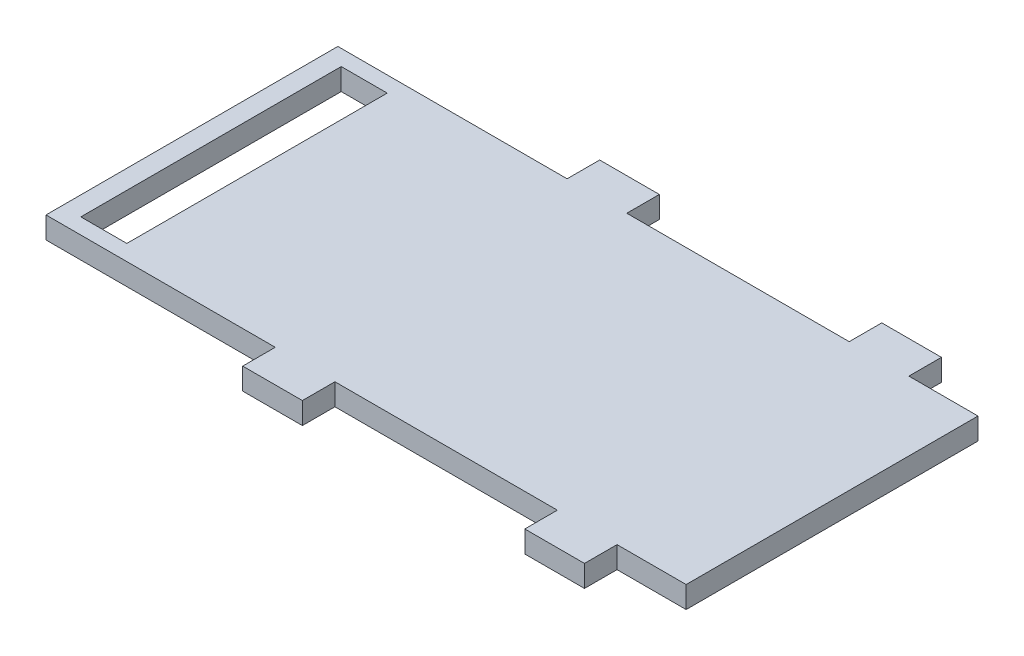
ISO-10303-21;
HEADER;
FILE_DESCRIPTION(('STEP AP214'),'2;1');
FILE_NAME('part.step','',(''),(''),'','','');
FILE_SCHEMA(('AUTOMOTIVE_DESIGN { 1 0 10303 214 1 1 1 1 }'));
ENDSEC;
DATA;
#1=APPLICATION_CONTEXT('core data for automotive mechanical design processes');
#2=APPLICATION_PROTOCOL_DEFINITION('international standard','automotive_design',2000,#1);
#3=PRODUCT_CONTEXT('',#1,'mechanical');
#4=PRODUCT('Part','Part','',(#3));
#5=PRODUCT_RELATED_PRODUCT_CATEGORY('part','',(#4));
#6=PRODUCT_DEFINITION_FORMATION('','',#4);
#7=PRODUCT_DEFINITION_CONTEXT('part definition',#1,'design');
#8=PRODUCT_DEFINITION('design','',#6,#7);
#9=PRODUCT_DEFINITION_SHAPE('','',#8);
#10=(LENGTH_UNIT() NAMED_UNIT(*) SI_UNIT(.MILLI.,.METRE.));
#11=(NAMED_UNIT(*) PLANE_ANGLE_UNIT() SI_UNIT($,.RADIAN.));
#12=(NAMED_UNIT(*) SI_UNIT($,.STERADIAN.) SOLID_ANGLE_UNIT());
#13=UNCERTAINTY_MEASURE_WITH_UNIT(LENGTH_MEASURE(1.E-05),#10,'distance_accuracy_value','');
#14=(GEOMETRIC_REPRESENTATION_CONTEXT(3) GLOBAL_UNCERTAINTY_ASSIGNED_CONTEXT((#13)) GLOBAL_UNIT_ASSIGNED_CONTEXT((#10,
#11,#12)) REPRESENTATION_CONTEXT('',''));
#15=CARTESIAN_POINT('',(0.,0.,0.));
#16=DIRECTION('',(0.,0.,1.));
#17=DIRECTION('',(1.,0.,0.));
#18=AXIS2_PLACEMENT_3D('',#15,#16,#17);
#19=CARTESIAN_POINT('',(-50.7984236509872,1.,18.7804542334295));
#20=DIRECTION('',(0.,0.,-1.));
#21=DIRECTION('',(-1.,0.,0.));
#22=AXIS2_PLACEMENT_3D('',#19,#20,#21);
#23=PLANE('',#22);
#24=DIRECTION('',(0.,-1.,0.));
#25=VECTOR('',#24,1.);
#26=CARTESIAN_POINT('',(-27.2334236509872,1.,18.7804542334295));
#27=LINE('',#26,#25);
#28=CARTESIAN_POINT('',(-27.2334236509872,1.,18.7804542334295));
#29=VERTEX_POINT('',#28);
#30=CARTESIAN_POINT('',(-27.2334236509872,0.,18.7804542334295));
#31=VERTEX_POINT('',#30);
#32=EDGE_CURVE('E243',#29,#31,#27,.T.);
#33=ORIENTED_EDGE('',*,*,#32,.F.);
#34=DIRECTION('',(1.,0.,0.));
#35=VECTOR('',#34,1.);
#36=CARTESIAN_POINT('',(-50.7984236509872,1.,18.7804542334295));
#37=LINE('',#36,#35);
#38=CARTESIAN_POINT('',(-37.4834236509872,1.,18.7804542334295));
#39=VERTEX_POINT('',#38);
#40=EDGE_CURVE('E428',#39,#29,#37,.T.);
#41=ORIENTED_EDGE('',*,*,#40,.F.);
#42=DIRECTION('',(0.,-1.,0.));
#43=VECTOR('',#42,1.);
#44=CARTESIAN_POINT('',(-37.4834236509872,1.,18.7804542334295));
#45=LINE('',#44,#43);
#46=CARTESIAN_POINT('',(-37.4834236509872,0.,18.7804542334295));
#47=VERTEX_POINT('',#46);
#48=EDGE_CURVE('E303',#39,#47,#45,.T.);
#49=ORIENTED_EDGE('',*,*,#48,.T.);
#50=DIRECTION('',(1.,0.,0.));
#51=VECTOR('',#50,1.);
#52=CARTESIAN_POINT('',(-50.7984236509872,0.,18.7804542334295));
#53=LINE('',#52,#51);
#54=EDGE_CURVE('E367',#47,#31,#53,.T.);
#55=ORIENTED_EDGE('',*,*,#54,.T.);
#56=EDGE_LOOP('',(#33,#41,#49,#55));
#57=FACE_BOUND('',#56,.T.);
#58=ADVANCED_FACE('F33',(#57),#23,.F.);
#59=DIRECTION('',(0.,-1.,0.));
#60=VECTOR('',#59,1.);
#61=CARTESIAN_POINT('',(-24.4834236509872,1.,18.7804542334295));
#62=LINE('',#61,#60);
#63=CARTESIAN_POINT('',(-24.4834236509872,1.,18.7804542334295));
#64=VERTEX_POINT('',#63);
#65=CARTESIAN_POINT('',(-24.4834236509872,0.,18.7804542334295));
#66=VERTEX_POINT('',#65);
#67=EDGE_CURVE('E252',#64,#66,#62,.T.);
#68=ORIENTED_EDGE('',*,*,#67,.T.);
#69=CARTESIAN_POINT('',(-21.2984236509872,0.,18.7804542334295));
#70=VERTEX_POINT('',#69);
#71=EDGE_CURVE('E361',#66,#70,#53,.T.);
#72=ORIENTED_EDGE('',*,*,#71,.T.);
#73=DIRECTION('',(0.,-1.,0.));
#74=VECTOR('',#73,1.);
#75=CARTESIAN_POINT('',(-21.2984236509872,1.,18.7804542334295));
#76=LINE('',#75,#74);
#77=CARTESIAN_POINT('',(-21.2984236509872,1.,18.7804542334295));
#78=VERTEX_POINT('',#77);
#79=EDGE_CURVE('E43',#78,#70,#76,.T.);
#80=ORIENTED_EDGE('',*,*,#79,.F.);
#81=EDGE_CURVE('E37',#64,#78,#37,.T.);
#82=ORIENTED_EDGE('',*,*,#81,.F.);
#83=EDGE_LOOP('',(#68,#72,#80,#82));
#84=FACE_BOUND('',#83,.T.);
#85=ADVANCED_FACE('F467',(#84),#23,.F.);
#86=CARTESIAN_POINT('',(-50.7984236509872,1.,5.33045423342954));
#87=DIRECTION('',(0.,0.,1.));
#88=DIRECTION('',(1.,0.,0.));
#89=AXIS2_PLACEMENT_3D('',#86,#87,#88);
#90=PLANE('',#89);
#91=DIRECTION('',(0.,-1.,0.));
#92=VECTOR('',#91,1.);
#93=CARTESIAN_POINT('',(-24.4834236509872,1.,5.33045423342954));
#94=LINE('',#93,#92);
#95=CARTESIAN_POINT('',(-24.4834236509872,1.,5.33045423342954));
#96=VERTEX_POINT('',#95);
#97=CARTESIAN_POINT('',(-24.4834236509872,0.,5.33045423342954));
#98=VERTEX_POINT('',#97);
#99=EDGE_CURVE('E284',#96,#98,#94,.T.);
#100=ORIENTED_EDGE('',*,*,#99,.F.);
#101=DIRECTION('',(-1.,0.,0.));
#102=VECTOR('',#101,1.);
#103=CARTESIAN_POINT('',(-50.7984236509872,1.,5.33045423342954));
#104=LINE('',#103,#102);
#105=CARTESIAN_POINT('',(-21.2984236509872,1.,5.33045423342954));
#106=VERTEX_POINT('',#105);
#107=EDGE_CURVE('E343',#106,#96,#104,.T.);
#108=ORIENTED_EDGE('',*,*,#107,.F.);
#109=DIRECTION('',(0.,-1.,0.));
#110=VECTOR('',#109,1.);
#111=CARTESIAN_POINT('',(-21.2984236509872,1.,5.33045423342954));
#112=LINE('',#111,#110);
#113=CARTESIAN_POINT('',(-21.2984236509872,0.,5.33045423342954));
#114=VERTEX_POINT('',#113);
#115=EDGE_CURVE('E336',#106,#114,#112,.T.);
#116=ORIENTED_EDGE('',*,*,#115,.T.);
#117=DIRECTION('',(-1.,0.,0.));
#118=VECTOR('',#117,1.);
#119=CARTESIAN_POINT('',(-50.7984236509872,0.,5.33045423342954));
#120=LINE('',#119,#118);
#121=EDGE_CURVE('E317',#114,#98,#120,.T.);
#122=ORIENTED_EDGE('',*,*,#121,.T.);
#123=EDGE_LOOP('',(#100,#108,#116,#122));
#124=FACE_BOUND('',#123,.T.);
#125=ADVANCED_FACE('F493',(#124),#90,.F.);
#126=DIRECTION('',(0.,-1.,0.));
#127=VECTOR('',#126,1.);
#128=CARTESIAN_POINT('',(-27.2334236509872,1.,5.33045423342954));
#129=LINE('',#128,#127);
#130=CARTESIAN_POINT('',(-27.2334236509872,1.,5.33045423342954));
#131=VERTEX_POINT('',#130);
#132=CARTESIAN_POINT('',(-27.2334236509872,0.,5.33045423342954));
#133=VERTEX_POINT('',#132);
#134=EDGE_CURVE('E270',#131,#133,#129,.T.);
#135=ORIENTED_EDGE('',*,*,#134,.T.);
#136=CARTESIAN_POINT('',(-37.4834236509872,0.,5.33045423342954));
#137=VERTEX_POINT('',#136);
#138=EDGE_CURVE('E314',#133,#137,#120,.T.);
#139=ORIENTED_EDGE('',*,*,#138,.T.);
#140=DIRECTION('',(0.,-1.,0.));
#141=VECTOR('',#140,1.);
#142=CARTESIAN_POINT('',(-37.4834236509872,1.,5.33045423342954));
#143=LINE('',#142,#141);
#144=CARTESIAN_POINT('',(-37.4834236509872,1.,5.33045423342954));
#145=VERTEX_POINT('',#144);
#146=EDGE_CURVE('E385',#145,#137,#143,.T.);
#147=ORIENTED_EDGE('',*,*,#146,.F.);
#148=EDGE_CURVE('E319',#131,#145,#104,.T.);
#149=ORIENTED_EDGE('',*,*,#148,.F.);
#150=EDGE_LOOP('',(#135,#139,#147,#149));
#151=FACE_BOUND('',#150,.T.);
#152=ADVANCED_FACE('F496',(#151),#90,.F.);
#153=DIRECTION('',(0.,-1.,0.));
#154=VECTOR('',#153,1.);
#155=CARTESIAN_POINT('',(-40.2334236509872,1.,18.7804542334295));
#156=LINE('',#155,#154);
#157=CARTESIAN_POINT('',(-40.2334236509872,1.,18.7804542334295));
#158=VERTEX_POINT('',#157);
#159=CARTESIAN_POINT('',(-40.2334236509872,0.,18.7804542334295));
#160=VERTEX_POINT('',#159);
#161=EDGE_CURVE('E300',#158,#160,#156,.T.);
#162=ORIENTED_EDGE('',*,*,#161,.F.);
#163=CARTESIAN_POINT('',(-50.7984236509872,1.,18.7804542334295));
#164=VERTEX_POINT('',#163);
#165=EDGE_CURVE('E425',#164,#158,#37,.T.);
#166=ORIENTED_EDGE('',*,*,#165,.F.);
#167=DIRECTION('',(0.,-1.,0.));
#168=VECTOR('',#167,1.);
#169=CARTESIAN_POINT('',(-50.7984236509872,1.,18.7804542334295));
#170=LINE('',#169,#168);
#171=CARTESIAN_POINT('',(-50.7984236509872,0.,18.7804542334295));
#172=VERTEX_POINT('',#171);
#173=EDGE_CURVE('E11',#164,#172,#170,.T.);
#174=ORIENTED_EDGE('',*,*,#173,.T.);
#175=EDGE_CURVE('E370',#172,#160,#53,.T.);
#176=ORIENTED_EDGE('',*,*,#175,.T.);
#177=EDGE_LOOP('',(#162,#166,#174,#176));
#178=FACE_BOUND('',#177,.T.);
#179=ADVANCED_FACE('F471',(#178),#23,.F.);
#180=CARTESIAN_POINT('',(-50.7984236509872,1.,5.33045423342954));
#181=DIRECTION('',(1.,0.,0.));
#182=DIRECTION('',(0.,0.,-1.));
#183=AXIS2_PLACEMENT_3D('',#180,#181,#182);
#184=PLANE('',#183);
#185=DIRECTION('',(0.,0.,1.));
#186=VECTOR('',#185,1.);
#187=CARTESIAN_POINT('',(-50.7984236509872,0.,5.33045423342954));
#188=LINE('',#187,#186);
#189=CARTESIAN_POINT('',(-50.7984236509872,0.,5.33045423342954));
#190=VERTEX_POINT('',#189);
#191=EDGE_CURVE('E358',#190,#172,#188,.T.);
#192=ORIENTED_EDGE('',*,*,#191,.T.);
#193=ORIENTED_EDGE('',*,*,#173,.F.);
#194=DIRECTION('',(0.,0.,1.));
#195=VECTOR('',#194,1.);
#196=CARTESIAN_POINT('',(-50.7984236509872,1.,5.33045423342954));
#197=LINE('',#196,#195);
#198=CARTESIAN_POINT('',(-50.7984236509872,1.,5.33045423342954));
#199=VERTEX_POINT('',#198);
#200=EDGE_CURVE('E333',#199,#164,#197,.T.);
#201=ORIENTED_EDGE('',*,*,#200,.F.);
#202=DIRECTION('',(0.,-1.,0.));
#203=VECTOR('',#202,1.);
#204=CARTESIAN_POINT('',(-50.7984236509872,1.,5.33045423342954));
#205=LINE('',#204,#203);
#206=EDGE_CURVE('E326',#199,#190,#205,.T.);
#207=ORIENTED_EDGE('',*,*,#206,.T.);
#208=EDGE_LOOP('',(#192,#193,#201,#207));
#209=FACE_BOUND('',#208,.T.);
#210=ADVANCED_FACE('F35',(#209),#184,.F.);
#211=CARTESIAN_POINT('',(-21.2984236509872,1.,5.33045423342954));
#212=DIRECTION('',(-1.,0.,0.));
#213=DIRECTION('',(0.,0.,1.));
#214=AXIS2_PLACEMENT_3D('',#211,#212,#213);
#215=PLANE('',#214);
#216=DIRECTION('',(0.,0.,-1.));
#217=VECTOR('',#216,1.);
#218=CARTESIAN_POINT('',(-21.2984236509872,0.,5.33045423342954));
#219=LINE('',#218,#217);
#220=EDGE_CURVE('E324',#70,#114,#219,.T.);
#221=ORIENTED_EDGE('',*,*,#220,.T.);
#222=ORIENTED_EDGE('',*,*,#115,.F.);
#223=DIRECTION('',(0.,0.,-1.));
#224=VECTOR('',#223,1.);
#225=CARTESIAN_POINT('',(-21.2984236509872,1.,5.33045423342954));
#226=LINE('',#225,#224);
#227=EDGE_CURVE('E357',#78,#106,#226,.T.);
#228=ORIENTED_EDGE('',*,*,#227,.F.);
#229=ORIENTED_EDGE('',*,*,#79,.T.);
#230=EDGE_LOOP('',(#221,#222,#228,#229));
#231=FACE_BOUND('',#230,.T.);
#232=ADVANCED_FACE('F501',(#231),#215,.F.);
#233=CARTESIAN_POINT('',(-40.2334236509872,1.,5.33045423342954));
#234=VERTEX_POINT('',#233);
#235=EDGE_CURVE('E351',#234,#199,#104,.T.);
#236=ORIENTED_EDGE('',*,*,#235,.F.);
#237=DIRECTION('',(0.,-1.,0.));
#238=VECTOR('',#237,1.);
#239=CARTESIAN_POINT('',(-40.2334236509872,1.,5.33045423342954));
#240=LINE('',#239,#238);
#241=CARTESIAN_POINT('',(-40.2334236509872,0.,5.33045423342954));
#242=VERTEX_POINT('',#241);
#243=EDGE_CURVE('E362',#234,#242,#240,.T.);
#244=ORIENTED_EDGE('',*,*,#243,.T.);
#245=EDGE_CURVE('E318',#242,#190,#120,.T.);
#246=ORIENTED_EDGE('',*,*,#245,.T.);
#247=ORIENTED_EDGE('',*,*,#206,.F.);
#248=EDGE_LOOP('',(#236,#244,#246,#247));
#249=FACE_BOUND('',#248,.T.);
#250=ADVANCED_FACE('F424',(#249),#90,.F.);
#251=CARTESIAN_POINT('',(0.,1.,0.));
#252=DIRECTION('',(0.,1.,0.));
#253=DIRECTION('',(0.,0.,1.));
#254=AXIS2_PLACEMENT_3D('',#251,#252,#253);
#255=PLANE('',#254);
#256=DIRECTION('',(0.,0.,-1.));
#257=VECTOR('',#256,1.);
#258=CARTESIAN_POINT('',(-49.9184236509872,1.,18.0554542334295));
#259=LINE('',#258,#257);
#260=CARTESIAN_POINT('',(-49.9184236509872,1.,18.0554542334295));
#261=VERTEX_POINT('',#260);
#262=CARTESIAN_POINT('',(-49.9184236509872,1.,6.05545423342955));
#263=VERTEX_POINT('',#262);
#264=EDGE_CURVE('E199',#261,#263,#259,.T.);
#265=ORIENTED_EDGE('',*,*,#264,.T.);
#266=DIRECTION('',(1.,0.,0.));
#267=VECTOR('',#266,1.);
#268=CARTESIAN_POINT('',(-49.9184236509872,1.,6.05545423342955));
#269=LINE('',#268,#267);
#270=CARTESIAN_POINT('',(-47.7984236509872,1.,6.05545423342955));
#271=VERTEX_POINT('',#270);
#272=EDGE_CURVE('E208',#263,#271,#269,.T.);
#273=ORIENTED_EDGE('',*,*,#272,.T.);
#274=DIRECTION('',(0.,0.,1.));
#275=VECTOR('',#274,1.);
#276=CARTESIAN_POINT('',(-47.7984236509872,1.,18.0554542334295));
#277=LINE('',#276,#275);
#278=CARTESIAN_POINT('',(-47.7984236509872,1.,18.0554542334295));
#279=VERTEX_POINT('',#278);
#280=EDGE_CURVE('E51',#271,#279,#277,.T.);
#281=ORIENTED_EDGE('',*,*,#280,.T.);
#282=DIRECTION('',(-1.,0.,0.));
#283=VECTOR('',#282,1.);
#284=CARTESIAN_POINT('',(-49.9184236509872,1.,18.0554542334295));
#285=LINE('',#284,#283);
#286=EDGE_CURVE('E205',#279,#261,#285,.T.);
#287=ORIENTED_EDGE('',*,*,#286,.T.);
#288=EDGE_LOOP('',(#265,#273,#281,#287));
#289=FACE_BOUND('',#288,.T.);
#290=ORIENTED_EDGE('',*,*,#200,.T.);
#291=ORIENTED_EDGE('',*,*,#165,.T.);
#292=DIRECTION('',(0.,0.,1.));
#293=VECTOR('',#292,1.);
#294=CARTESIAN_POINT('',(-40.2334236509872,1.,18.7804542334295));
#295=LINE('',#294,#293);
#296=CARTESIAN_POINT('',(-40.2334236509872,1.,20.2804542334295));
#297=VERTEX_POINT('',#296);
#298=EDGE_CURVE('E291',#158,#297,#295,.T.);
#299=ORIENTED_EDGE('',*,*,#298,.T.);
#300=DIRECTION('',(1.,0.,0.));
#301=VECTOR('',#300,1.);
#302=CARTESIAN_POINT('',(-40.2334236509872,1.,20.2804542334295));
#303=LINE('',#302,#301);
#304=CARTESIAN_POINT('',(-37.4834236509872,1.,20.2804542334295));
#305=VERTEX_POINT('',#304);
#306=EDGE_CURVE('E288',#297,#305,#303,.T.);
#307=ORIENTED_EDGE('',*,*,#306,.T.);
#308=DIRECTION('',(0.,0.,-1.));
#309=VECTOR('',#308,1.);
#310=CARTESIAN_POINT('',(-37.4834236509872,1.,18.7804542334295));
#311=LINE('',#310,#309);
#312=EDGE_CURVE('E290',#305,#39,#311,.T.);
#313=ORIENTED_EDGE('',*,*,#312,.T.);
#314=ORIENTED_EDGE('',*,*,#40,.T.);
#315=DIRECTION('',(0.,0.,1.));
#316=VECTOR('',#315,1.);
#317=CARTESIAN_POINT('',(-27.2334236509872,1.,18.7804542334295));
#318=LINE('',#317,#316);
#319=CARTESIAN_POINT('',(-27.2334236509872,1.,20.2804542334295));
#320=VERTEX_POINT('',#319);
#321=EDGE_CURVE('E234',#29,#320,#318,.T.);
#322=ORIENTED_EDGE('',*,*,#321,.T.);
#323=DIRECTION('',(1.,0.,0.));
#324=VECTOR('',#323,1.);
#325=CARTESIAN_POINT('',(-27.2334236509872,1.,20.2804542334295));
#326=LINE('',#325,#324);
#327=CARTESIAN_POINT('',(-24.4834236509872,1.,20.2804542334295));
#328=VERTEX_POINT('',#327);
#329=EDGE_CURVE('E237',#320,#328,#326,.T.);
#330=ORIENTED_EDGE('',*,*,#329,.T.);
#331=DIRECTION('',(0.,0.,-1.));
#332=VECTOR('',#331,1.);
#333=CARTESIAN_POINT('',(-24.4834236509872,1.,18.7804542334295));
#334=LINE('',#333,#332);
#335=EDGE_CURVE('E240',#328,#64,#334,.T.);
#336=ORIENTED_EDGE('',*,*,#335,.T.);
#337=ORIENTED_EDGE('',*,*,#81,.T.);
#338=ORIENTED_EDGE('',*,*,#227,.T.);
#339=ORIENTED_EDGE('',*,*,#107,.T.);
#340=DIRECTION('',(0.,0.,-1.));
#341=VECTOR('',#340,1.);
#342=CARTESIAN_POINT('',(-24.4834236509872,1.,5.33045423342954));
#343=LINE('',#342,#341);
#344=CARTESIAN_POINT('',(-24.4834236509872,1.,3.83045423342955));
#345=VERTEX_POINT('',#344);
#346=EDGE_CURVE('E262',#96,#345,#343,.T.);
#347=ORIENTED_EDGE('',*,*,#346,.T.);
#348=DIRECTION('',(-1.,0.,0.));
#349=VECTOR('',#348,1.);
#350=CARTESIAN_POINT('',(-27.2334236509872,1.,3.83045423342955));
#351=LINE('',#350,#349);
#352=CARTESIAN_POINT('',(-27.2334236509872,1.,3.83045423342955));
#353=VERTEX_POINT('',#352);
#354=EDGE_CURVE('E264',#345,#353,#351,.T.);
#355=ORIENTED_EDGE('',*,*,#354,.T.);
#356=DIRECTION('',(0.,0.,1.));
#357=VECTOR('',#356,1.);
#358=CARTESIAN_POINT('',(-27.2334236509872,1.,5.33045423342954));
#359=LINE('',#358,#357);
#360=EDGE_CURVE('E267',#353,#131,#359,.T.);
#361=ORIENTED_EDGE('',*,*,#360,.T.);
#362=ORIENTED_EDGE('',*,*,#148,.T.);
#363=DIRECTION('',(0.,0.,-1.));
#364=VECTOR('',#363,1.);
#365=CARTESIAN_POINT('',(-37.4834236509872,1.,5.33045423342954));
#366=LINE('',#365,#364);
#367=CARTESIAN_POINT('',(-37.4834236509872,1.,3.83045423342955));
#368=VERTEX_POINT('',#367);
#369=EDGE_CURVE('E381',#145,#368,#366,.T.);
#370=ORIENTED_EDGE('',*,*,#369,.T.);
#371=DIRECTION('',(-1.,0.,0.));
#372=VECTOR('',#371,1.);
#373=CARTESIAN_POINT('',(-40.2334236509872,1.,3.83045423342955));
#374=LINE('',#373,#372);
#375=CARTESIAN_POINT('',(-40.2334236509872,1.,3.83045423342955));
#376=VERTEX_POINT('',#375);
#377=EDGE_CURVE('E383',#368,#376,#374,.T.);
#378=ORIENTED_EDGE('',*,*,#377,.T.);
#379=DIRECTION('',(0.,0.,1.));
#380=VECTOR('',#379,1.);
#381=CARTESIAN_POINT('',(-40.2334236509872,1.,5.33045423342954));
#382=LINE('',#381,#380);
#383=EDGE_CURVE('E384',#376,#234,#382,.T.);
#384=ORIENTED_EDGE('',*,*,#383,.T.);
#385=ORIENTED_EDGE('',*,*,#235,.T.);
#386=EDGE_LOOP('',(#290,#291,#299,#307,#313,#314,#322,#330,#336,#337,#338,#339,#347,#355,#361,
#362,#370,#378,#384,#385));
#387=FACE_BOUND('',#386,.T.);
#388=ADVANCED_FACE('F212',(#289,#387),#255,.T.);
#389=CARTESIAN_POINT('',(0.,0.,0.));
#390=DIRECTION('',(0.,1.,0.));
#391=DIRECTION('',(0.,0.,1.));
#392=AXIS2_PLACEMENT_3D('',#389,#390,#391);
#393=PLANE('',#392);
#394=DIRECTION('',(1.,0.,0.));
#395=VECTOR('',#394,1.);
#396=CARTESIAN_POINT('',(-49.9184236509872,0.,6.05545423342955));
#397=LINE('',#396,#395);
#398=CARTESIAN_POINT('',(-49.9184236509872,0.,6.05545423342955));
#399=VERTEX_POINT('',#398);
#400=CARTESIAN_POINT('',(-47.7984236509872,0.,6.05545423342955));
#401=VERTEX_POINT('',#400);
#402=EDGE_CURVE('E224',#399,#401,#397,.T.);
#403=ORIENTED_EDGE('',*,*,#402,.F.);
#404=DIRECTION('',(0.,0.,-1.));
#405=VECTOR('',#404,1.);
#406=CARTESIAN_POINT('',(-49.9184236509872,0.,18.0554542334295));
#407=LINE('',#406,#405);
#408=CARTESIAN_POINT('',(-49.9184236509872,0.,18.0554542334295));
#409=VERTEX_POINT('',#408);
#410=EDGE_CURVE('E59',#409,#399,#407,.T.);
#411=ORIENTED_EDGE('',*,*,#410,.F.);
#412=DIRECTION('',(-1.,0.,0.));
#413=VECTOR('',#412,1.);
#414=CARTESIAN_POINT('',(-49.9184236509872,0.,18.0554542334295));
#415=LINE('',#414,#413);
#416=CARTESIAN_POINT('',(-47.7984236509872,0.,18.0554542334295));
#417=VERTEX_POINT('',#416);
#418=EDGE_CURVE('E215',#417,#409,#415,.T.);
#419=ORIENTED_EDGE('',*,*,#418,.F.);
#420=DIRECTION('',(0.,0.,1.));
#421=VECTOR('',#420,1.);
#422=CARTESIAN_POINT('',(-47.7984236509872,0.,18.0554542334295));
#423=LINE('',#422,#421);
#424=EDGE_CURVE('E218',#401,#417,#423,.T.);
#425=ORIENTED_EDGE('',*,*,#424,.F.);
#426=EDGE_LOOP('',(#403,#411,#419,#425));
#427=FACE_BOUND('',#426,.T.);
#428=ORIENTED_EDGE('',*,*,#191,.F.);
#429=ORIENTED_EDGE('',*,*,#245,.F.);
#430=DIRECTION('',(0.,0.,1.));
#431=VECTOR('',#430,1.);
#432=CARTESIAN_POINT('',(-40.2334236509872,0.,5.33045423342954));
#433=LINE('',#432,#431);
#434=CARTESIAN_POINT('',(-40.2334236509872,0.,3.83045423342955));
#435=VERTEX_POINT('',#434);
#436=EDGE_CURVE('E378',#435,#242,#433,.T.);
#437=ORIENTED_EDGE('',*,*,#436,.F.);
#438=DIRECTION('',(-1.,0.,0.));
#439=VECTOR('',#438,1.);
#440=CARTESIAN_POINT('',(-40.2334236509872,0.,3.83045423342955));
#441=LINE('',#440,#439);
#442=CARTESIAN_POINT('',(-37.4834236509872,0.,3.83045423342955));
#443=VERTEX_POINT('',#442);
#444=EDGE_CURVE('E377',#443,#435,#441,.T.);
#445=ORIENTED_EDGE('',*,*,#444,.F.);
#446=DIRECTION('',(0.,0.,-1.));
#447=VECTOR('',#446,1.);
#448=CARTESIAN_POINT('',(-37.4834236509872,0.,5.33045423342954));
#449=LINE('',#448,#447);
#450=EDGE_CURVE('E375',#137,#443,#449,.T.);
#451=ORIENTED_EDGE('',*,*,#450,.F.);
#452=ORIENTED_EDGE('',*,*,#138,.F.);
#453=DIRECTION('',(0.,0.,1.));
#454=VECTOR('',#453,1.);
#455=CARTESIAN_POINT('',(-27.2334236509872,0.,5.33045423342954));
#456=LINE('',#455,#454);
#457=CARTESIAN_POINT('',(-27.2334236509872,0.,3.83045423342955));
#458=VERTEX_POINT('',#457);
#459=EDGE_CURVE('E265',#458,#133,#456,.T.);
#460=ORIENTED_EDGE('',*,*,#459,.F.);
#461=DIRECTION('',(-1.,0.,0.));
#462=VECTOR('',#461,1.);
#463=CARTESIAN_POINT('',(-27.2334236509872,0.,3.83045423342955));
#464=LINE('',#463,#462);
#465=CARTESIAN_POINT('',(-24.4834236509872,0.,3.83045423342955));
#466=VERTEX_POINT('',#465);
#467=EDGE_CURVE('E272',#466,#458,#464,.T.);
#468=ORIENTED_EDGE('',*,*,#467,.F.);
#469=DIRECTION('',(0.,0.,-1.));
#470=VECTOR('',#469,1.);
#471=CARTESIAN_POINT('',(-24.4834236509872,0.,5.33045423342954));
#472=LINE('',#471,#470);
#473=EDGE_CURVE('E261',#98,#466,#472,.T.);
#474=ORIENTED_EDGE('',*,*,#473,.F.);
#475=ORIENTED_EDGE('',*,*,#121,.F.);
#476=ORIENTED_EDGE('',*,*,#220,.F.);
#477=ORIENTED_EDGE('',*,*,#71,.F.);
#478=DIRECTION('',(0.,0.,-1.));
#479=VECTOR('',#478,1.);
#480=CARTESIAN_POINT('',(-24.4834236509872,0.,18.7804542334295));
#481=LINE('',#480,#479);
#482=CARTESIAN_POINT('',(-24.4834236509872,0.,20.2804542334295));
#483=VERTEX_POINT('',#482);
#484=EDGE_CURVE('E238',#483,#66,#481,.T.);
#485=ORIENTED_EDGE('',*,*,#484,.F.);
#486=DIRECTION('',(1.,0.,0.));
#487=VECTOR('',#486,1.);
#488=CARTESIAN_POINT('',(-27.2334236509872,0.,20.2804542334295));
#489=LINE('',#488,#487);
#490=CARTESIAN_POINT('',(-27.2334236509872,0.,20.2804542334295));
#491=VERTEX_POINT('',#490);
#492=EDGE_CURVE('E246',#491,#483,#489,.T.);
#493=ORIENTED_EDGE('',*,*,#492,.F.);
#494=DIRECTION('',(0.,0.,1.));
#495=VECTOR('',#494,1.);
#496=CARTESIAN_POINT('',(-27.2334236509872,0.,18.7804542334295));
#497=LINE('',#496,#495);
#498=EDGE_CURVE('E230',#31,#491,#497,.T.);
#499=ORIENTED_EDGE('',*,*,#498,.F.);
#500=ORIENTED_EDGE('',*,*,#54,.F.);
#501=DIRECTION('',(0.,0.,-1.));
#502=VECTOR('',#501,1.);
#503=CARTESIAN_POINT('',(-37.4834236509872,0.,18.7804542334295));
#504=LINE('',#503,#502);
#505=CARTESIAN_POINT('',(-37.4834236509872,0.,20.2804542334295));
#506=VERTEX_POINT('',#505);
#507=EDGE_CURVE('E294',#506,#47,#504,.T.);
#508=ORIENTED_EDGE('',*,*,#507,.F.);
#509=DIRECTION('',(1.,0.,0.));
#510=VECTOR('',#509,1.);
#511=CARTESIAN_POINT('',(-40.2334236509872,0.,20.2804542334295));
#512=LINE('',#511,#510);
#513=CARTESIAN_POINT('',(-40.2334236509872,0.,20.2804542334295));
#514=VERTEX_POINT('',#513);
#515=EDGE_CURVE('E292',#514,#506,#512,.T.);
#516=ORIENTED_EDGE('',*,*,#515,.F.);
#517=DIRECTION('',(0.,0.,1.));
#518=VECTOR('',#517,1.);
#519=CARTESIAN_POINT('',(-40.2334236509872,0.,18.7804542334295));
#520=LINE('',#519,#518);
#521=EDGE_CURVE('E287',#160,#514,#520,.T.);
#522=ORIENTED_EDGE('',*,*,#521,.F.);
#523=ORIENTED_EDGE('',*,*,#175,.F.);
#524=EDGE_LOOP('',(#428,#429,#437,#445,#451,#452,#460,#468,#474,#475,#476,#477,#485,#493,#499,
#500,#508,#516,#522,#523));
#525=FACE_BOUND('',#524,.T.);
#526=ADVANCED_FACE('F456',(#427,#525),#393,.F.);
#527=CARTESIAN_POINT('',(-40.2334236509872,1.,5.33045423342954));
#528=DIRECTION('',(1.,0.,0.));
#529=DIRECTION('',(0.,0.,-1.));
#530=AXIS2_PLACEMENT_3D('',#527,#528,#529);
#531=PLANE('',#530);
#532=ORIENTED_EDGE('',*,*,#436,.T.);
#533=ORIENTED_EDGE('',*,*,#243,.F.);
#534=ORIENTED_EDGE('',*,*,#383,.F.);
#535=DIRECTION('',(0.,-1.,0.));
#536=VECTOR('',#535,1.);
#537=CARTESIAN_POINT('',(-40.2334236509872,1.,3.83045423342955));
#538=LINE('',#537,#536);
#539=EDGE_CURVE('E412',#376,#435,#538,.T.);
#540=ORIENTED_EDGE('',*,*,#539,.T.);
#541=EDGE_LOOP('',(#532,#533,#534,#540));
#542=FACE_BOUND('',#541,.T.);
#543=ADVANCED_FACE('F420',(#542),#531,.F.);
#544=CARTESIAN_POINT('',(-37.4834236509872,1.,5.33045423342954));
#545=DIRECTION('',(-1.,0.,0.));
#546=DIRECTION('',(0.,0.,1.));
#547=AXIS2_PLACEMENT_3D('',#544,#545,#546);
#548=PLANE('',#547);
#549=ORIENTED_EDGE('',*,*,#450,.T.);
#550=DIRECTION('',(0.,-1.,0.));
#551=VECTOR('',#550,1.);
#552=CARTESIAN_POINT('',(-37.4834236509872,1.,3.83045423342955));
#553=LINE('',#552,#551);
#554=EDGE_CURVE('E389',#368,#443,#553,.T.);
#555=ORIENTED_EDGE('',*,*,#554,.F.);
#556=ORIENTED_EDGE('',*,*,#369,.F.);
#557=ORIENTED_EDGE('',*,*,#146,.T.);
#558=EDGE_LOOP('',(#549,#555,#556,#557));
#559=FACE_BOUND('',#558,.T.);
#560=ADVANCED_FACE('F521',(#559),#548,.F.);
#561=CARTESIAN_POINT('',(-40.2334236509872,1.,3.83045423342955));
#562=DIRECTION('',(0.,0.,1.));
#563=DIRECTION('',(1.,0.,0.));
#564=AXIS2_PLACEMENT_3D('',#561,#562,#563);
#565=PLANE('',#564);
#566=ORIENTED_EDGE('',*,*,#444,.T.);
#567=ORIENTED_EDGE('',*,*,#539,.F.);
#568=ORIENTED_EDGE('',*,*,#377,.F.);
#569=ORIENTED_EDGE('',*,*,#554,.T.);
#570=EDGE_LOOP('',(#566,#567,#568,#569));
#571=FACE_BOUND('',#570,.T.);
#572=ADVANCED_FACE('F419',(#571),#565,.F.);
#573=CARTESIAN_POINT('',(-40.2334236509872,1.,18.7804542334295));
#574=DIRECTION('',(1.,0.,0.));
#575=DIRECTION('',(0.,0.,-1.));
#576=AXIS2_PLACEMENT_3D('',#573,#574,#575);
#577=PLANE('',#576);
#578=ORIENTED_EDGE('',*,*,#521,.T.);
#579=DIRECTION('',(0.,-1.,0.));
#580=VECTOR('',#579,1.);
#581=CARTESIAN_POINT('',(-40.2334236509872,1.,20.2804542334295));
#582=LINE('',#581,#580);
#583=EDGE_CURVE('E478',#297,#514,#582,.T.);
#584=ORIENTED_EDGE('',*,*,#583,.F.);
#585=ORIENTED_EDGE('',*,*,#298,.F.);
#586=ORIENTED_EDGE('',*,*,#161,.T.);
#587=EDGE_LOOP('',(#578,#584,#585,#586));
#588=FACE_BOUND('',#587,.T.);
#589=ADVANCED_FACE('F474',(#588),#577,.F.);
#590=CARTESIAN_POINT('',(-40.2334236509872,1.,20.2804542334295));
#591=DIRECTION('',(0.,0.,-1.));
#592=DIRECTION('',(-1.,0.,0.));
#593=AXIS2_PLACEMENT_3D('',#590,#591,#592);
#594=PLANE('',#593);
#595=ORIENTED_EDGE('',*,*,#515,.T.);
#596=DIRECTION('',(0.,-1.,0.));
#597=VECTOR('',#596,1.);
#598=CARTESIAN_POINT('',(-37.4834236509872,1.,20.2804542334295));
#599=LINE('',#598,#597);
#600=EDGE_CURVE('E437',#305,#506,#599,.T.);
#601=ORIENTED_EDGE('',*,*,#600,.F.);
#602=ORIENTED_EDGE('',*,*,#306,.F.);
#603=ORIENTED_EDGE('',*,*,#583,.T.);
#604=EDGE_LOOP('',(#595,#601,#602,#603));
#605=FACE_BOUND('',#604,.T.);
#606=ADVANCED_FACE('F479',(#605),#594,.F.);
#607=CARTESIAN_POINT('',(-37.4834236509872,1.,18.7804542334295));
#608=DIRECTION('',(-1.,0.,0.));
#609=DIRECTION('',(0.,0.,1.));
#610=AXIS2_PLACEMENT_3D('',#607,#608,#609);
#611=PLANE('',#610);
#612=ORIENTED_EDGE('',*,*,#507,.T.);
#613=ORIENTED_EDGE('',*,*,#48,.F.);
#614=ORIENTED_EDGE('',*,*,#312,.F.);
#615=ORIENTED_EDGE('',*,*,#600,.T.);
#616=EDGE_LOOP('',(#612,#613,#614,#615));
#617=FACE_BOUND('',#616,.T.);
#618=ADVANCED_FACE('F447',(#617),#611,.F.);
#619=CARTESIAN_POINT('',(-24.4834236509872,1.,5.33045423342954));
#620=DIRECTION('',(-1.,0.,0.));
#621=DIRECTION('',(0.,0.,1.));
#622=AXIS2_PLACEMENT_3D('',#619,#620,#621);
#623=PLANE('',#622);
#624=ORIENTED_EDGE('',*,*,#473,.T.);
#625=DIRECTION('',(0.,-1.,0.));
#626=VECTOR('',#625,1.);
#627=CARTESIAN_POINT('',(-24.4834236509872,1.,3.83045423342955));
#628=LINE('',#627,#626);
#629=EDGE_CURVE('E281',#345,#466,#628,.T.);
#630=ORIENTED_EDGE('',*,*,#629,.F.);
#631=ORIENTED_EDGE('',*,*,#346,.F.);
#632=ORIENTED_EDGE('',*,*,#99,.T.);
#633=EDGE_LOOP('',(#624,#630,#631,#632));
#634=FACE_BOUND('',#633,.T.);
#635=ADVANCED_FACE('F486',(#634),#623,.F.);
#636=CARTESIAN_POINT('',(-27.2334236509872,1.,3.83045423342955));
#637=DIRECTION('',(0.,0.,1.));
#638=DIRECTION('',(1.,0.,0.));
#639=AXIS2_PLACEMENT_3D('',#636,#637,#638);
#640=PLANE('',#639);
#641=ORIENTED_EDGE('',*,*,#467,.T.);
#642=DIRECTION('',(0.,-1.,0.));
#643=VECTOR('',#642,1.);
#644=CARTESIAN_POINT('',(-27.2334236509872,1.,3.83045423342955));
#645=LINE('',#644,#643);
#646=EDGE_CURVE('E278',#353,#458,#645,.T.);
#647=ORIENTED_EDGE('',*,*,#646,.F.);
#648=ORIENTED_EDGE('',*,*,#354,.F.);
#649=ORIENTED_EDGE('',*,*,#629,.T.);
#650=EDGE_LOOP('',(#641,#647,#648,#649));
#651=FACE_BOUND('',#650,.T.);
#652=ADVANCED_FACE('F531',(#651),#640,.F.);
#653=CARTESIAN_POINT('',(-27.2334236509872,1.,5.33045423342954));
#654=DIRECTION('',(1.,0.,0.));
#655=DIRECTION('',(0.,0.,-1.));
#656=AXIS2_PLACEMENT_3D('',#653,#654,#655);
#657=PLANE('',#656);
#658=ORIENTED_EDGE('',*,*,#459,.T.);
#659=ORIENTED_EDGE('',*,*,#134,.F.);
#660=ORIENTED_EDGE('',*,*,#360,.F.);
#661=ORIENTED_EDGE('',*,*,#646,.T.);
#662=EDGE_LOOP('',(#658,#659,#660,#661));
#663=FACE_BOUND('',#662,.T.);
#664=ADVANCED_FACE('F526',(#663),#657,.F.);
#665=CARTESIAN_POINT('',(-27.2334236509872,1.,18.7804542334295));
#666=DIRECTION('',(1.,0.,0.));
#667=DIRECTION('',(0.,0.,-1.));
#668=AXIS2_PLACEMENT_3D('',#665,#666,#667);
#669=PLANE('',#668);
#670=ORIENTED_EDGE('',*,*,#498,.T.);
#671=DIRECTION('',(0.,-1.,0.));
#672=VECTOR('',#671,1.);
#673=CARTESIAN_POINT('',(-27.2334236509872,1.,20.2804542334295));
#674=LINE('',#673,#672);
#675=EDGE_CURVE('E258',#320,#491,#674,.T.);
#676=ORIENTED_EDGE('',*,*,#675,.F.);
#677=ORIENTED_EDGE('',*,*,#321,.F.);
#678=ORIENTED_EDGE('',*,*,#32,.T.);
#679=EDGE_LOOP('',(#670,#676,#677,#678));
#680=FACE_BOUND('',#679,.T.);
#681=ADVANCED_FACE('F453',(#680),#669,.F.);
#682=CARTESIAN_POINT('',(-27.2334236509872,1.,20.2804542334295));
#683=DIRECTION('',(0.,0.,-1.));
#684=DIRECTION('',(-1.,0.,0.));
#685=AXIS2_PLACEMENT_3D('',#682,#683,#684);
#686=PLANE('',#685);
#687=ORIENTED_EDGE('',*,*,#492,.T.);
#688=DIRECTION('',(0.,-1.,0.));
#689=VECTOR('',#688,1.);
#690=CARTESIAN_POINT('',(-24.4834236509872,1.,20.2804542334295));
#691=LINE('',#690,#689);
#692=EDGE_CURVE('E255',#328,#483,#691,.T.);
#693=ORIENTED_EDGE('',*,*,#692,.F.);
#694=ORIENTED_EDGE('',*,*,#329,.F.);
#695=ORIENTED_EDGE('',*,*,#675,.T.);
#696=EDGE_LOOP('',(#687,#693,#694,#695));
#697=FACE_BOUND('',#696,.T.);
#698=ADVANCED_FACE('F460',(#697),#686,.F.);
#699=CARTESIAN_POINT('',(-24.4834236509872,1.,18.7804542334295));
#700=DIRECTION('',(-1.,0.,0.));
#701=DIRECTION('',(0.,0.,1.));
#702=AXIS2_PLACEMENT_3D('',#699,#700,#701);
#703=PLANE('',#702);
#704=ORIENTED_EDGE('',*,*,#484,.T.);
#705=ORIENTED_EDGE('',*,*,#67,.F.);
#706=ORIENTED_EDGE('',*,*,#335,.F.);
#707=ORIENTED_EDGE('',*,*,#692,.T.);
#708=EDGE_LOOP('',(#704,#705,#706,#707));
#709=FACE_BOUND('',#708,.T.);
#710=ADVANCED_FACE('F465',(#709),#703,.F.);
#711=CARTESIAN_POINT('',(-49.9184236509872,1.,18.0554542334295));
#712=DIRECTION('',(-1.,0.,0.));
#713=DIRECTION('',(0.,0.,1.));
#714=AXIS2_PLACEMENT_3D('',#711,#712,#713);
#715=PLANE('',#714);
#716=ORIENTED_EDGE('',*,*,#410,.T.);
#717=DIRECTION('',(0.,-1.,0.));
#718=VECTOR('',#717,1.);
#719=CARTESIAN_POINT('',(-49.9184236509872,1.,6.05545423342955));
#720=LINE('',#719,#718);
#721=EDGE_CURVE('E195',#263,#399,#720,.T.);
#722=ORIENTED_EDGE('',*,*,#721,.F.);
#723=ORIENTED_EDGE('',*,*,#264,.F.);
#724=DIRECTION('',(0.,-1.,0.));
#725=VECTOR('',#724,1.);
#726=CARTESIAN_POINT('',(-49.9184236509872,1.,18.0554542334295));
#727=LINE('',#726,#725);
#728=EDGE_CURVE('E228',#261,#409,#727,.T.);
#729=ORIENTED_EDGE('',*,*,#728,.T.);
#730=EDGE_LOOP('',(#716,#722,#723,#729));
#731=FACE_BOUND('',#730,.T.);
#732=ADVANCED_FACE('F197',(#731),#715,.F.);
#733=CARTESIAN_POINT('',(-49.9184236509872,1.,18.0554542334295));
#734=DIRECTION('',(0.,0.,1.));
#735=DIRECTION('',(1.,0.,0.));
#736=AXIS2_PLACEMENT_3D('',#733,#734,#735);
#737=PLANE('',#736);
#738=ORIENTED_EDGE('',*,*,#418,.T.);
#739=ORIENTED_EDGE('',*,*,#728,.F.);
#740=ORIENTED_EDGE('',*,*,#286,.F.);
#741=DIRECTION('',(0.,-1.,0.));
#742=VECTOR('',#741,1.);
#743=CARTESIAN_POINT('',(-47.7984236509872,1.,18.0554542334295));
#744=LINE('',#743,#742);
#745=EDGE_CURVE('E231',#279,#417,#744,.T.);
#746=ORIENTED_EDGE('',*,*,#745,.T.);
#747=EDGE_LOOP('',(#738,#739,#740,#746));
#748=FACE_BOUND('',#747,.T.);
#749=ADVANCED_FACE('F552',(#748),#737,.F.);
#750=CARTESIAN_POINT('',(-47.7984236509872,1.,18.0554542334295));
#751=DIRECTION('',(1.,0.,0.));
#752=DIRECTION('',(0.,0.,-1.));
#753=AXIS2_PLACEMENT_3D('',#750,#751,#752);
#754=PLANE('',#753);
#755=ORIENTED_EDGE('',*,*,#424,.T.);
#756=ORIENTED_EDGE('',*,*,#745,.F.);
#757=ORIENTED_EDGE('',*,*,#280,.F.);
#758=DIRECTION('',(0.,-1.,0.));
#759=VECTOR('',#758,1.);
#760=CARTESIAN_POINT('',(-47.7984236509872,1.,6.05545423342955));
#761=LINE('',#760,#759);
#762=EDGE_CURVE('E204',#271,#401,#761,.T.);
#763=ORIENTED_EDGE('',*,*,#762,.T.);
#764=EDGE_LOOP('',(#755,#756,#757,#763));
#765=FACE_BOUND('',#764,.T.);
#766=ADVANCED_FACE('F555',(#765),#754,.F.);
#767=CARTESIAN_POINT('',(-49.9184236509872,1.,6.05545423342955));
#768=DIRECTION('',(0.,0.,-1.));
#769=DIRECTION('',(-1.,0.,0.));
#770=AXIS2_PLACEMENT_3D('',#767,#768,#769);
#771=PLANE('',#770);
#772=ORIENTED_EDGE('',*,*,#402,.T.);
#773=ORIENTED_EDGE('',*,*,#762,.F.);
#774=ORIENTED_EDGE('',*,*,#272,.F.);
#775=ORIENTED_EDGE('',*,*,#721,.T.);
#776=EDGE_LOOP('',(#772,#773,#774,#775));
#777=FACE_BOUND('',#776,.T.);
#778=ADVANCED_FACE('F209',(#777),#771,.F.);
#779=CLOSED_SHELL('',(#58,#85,#125,#152,#179,#210,#232,#250,#388,#526,#543,#560,#572,#589,#606,
#618,#635,#652,#664,#681,#698,#710,#732,#749,#766,#778));
#780=MANIFOLD_SOLID_BREP('B2',#779);
#781=ADVANCED_BREP_SHAPE_REPRESENTATION('',(#18,#780),#14);
#782=SHAPE_DEFINITION_REPRESENTATION(#9,#781);
ENDSEC;
END-ISO-10303-21;
